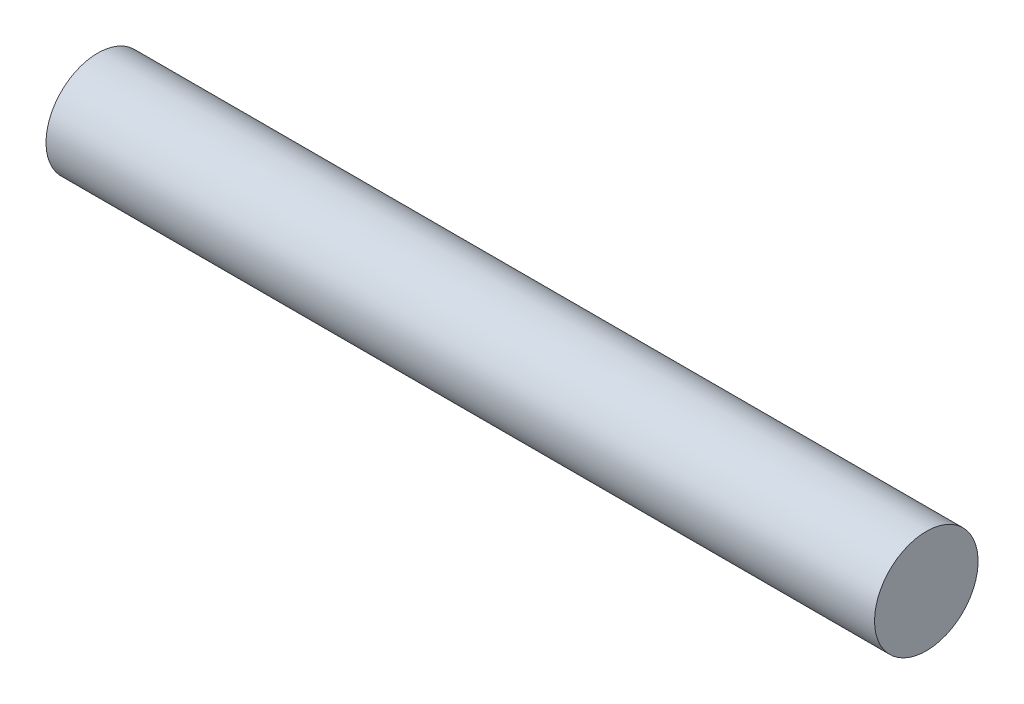
ISO-10303-21;
HEADER;
FILE_DESCRIPTION(('STEP AP214'),'2;1');
FILE_NAME('part.step','',(''),(''),'','','');
FILE_SCHEMA(('AUTOMOTIVE_DESIGN { 1 0 10303 214 1 1 1 1 }'));
ENDSEC;
DATA;
#1=APPLICATION_CONTEXT('core data for automotive mechanical design processes');
#2=APPLICATION_PROTOCOL_DEFINITION('international standard','automotive_design',2000,#1);
#3=PRODUCT_CONTEXT('',#1,'mechanical');
#4=PRODUCT('Part','Part','',(#3));
#5=PRODUCT_RELATED_PRODUCT_CATEGORY('part','',(#4));
#6=PRODUCT_DEFINITION_FORMATION('','',#4);
#7=PRODUCT_DEFINITION_CONTEXT('part definition',#1,'design');
#8=PRODUCT_DEFINITION('design','',#6,#7);
#9=PRODUCT_DEFINITION_SHAPE('','',#8);
#10=(LENGTH_UNIT() NAMED_UNIT(*) SI_UNIT(.MILLI.,.METRE.));
#11=(NAMED_UNIT(*) PLANE_ANGLE_UNIT() SI_UNIT($,.RADIAN.));
#12=(NAMED_UNIT(*) SI_UNIT($,.STERADIAN.) SOLID_ANGLE_UNIT());
#13=UNCERTAINTY_MEASURE_WITH_UNIT(LENGTH_MEASURE(1.E-05),#10,'distance_accuracy_value','');
#14=(GEOMETRIC_REPRESENTATION_CONTEXT(3) GLOBAL_UNCERTAINTY_ASSIGNED_CONTEXT((#13)) GLOBAL_UNIT_ASSIGNED_CONTEXT((#10,
#11,#12)) REPRESENTATION_CONTEXT('',''));
#15=CARTESIAN_POINT('',(0.,0.,0.));
#16=DIRECTION('',(0.,0.,1.));
#17=DIRECTION('',(1.,0.,0.));
#18=AXIS2_PLACEMENT_3D('',#15,#16,#17);
#19=CARTESIAN_POINT('',(381.,0.,0.));
#20=DIRECTION('',(1.,0.,0.));
#21=DIRECTION('',(0.,0.,-1.));
#22=AXIS2_PLACEMENT_3D('',#19,#20,#21);
#23=PLANE('',#22);
#24=CARTESIAN_POINT('',(381.,0.,0.));
#25=DIRECTION('',(-1.,0.,0.));
#26=DIRECTION('',(0.,0.,1.));
#27=AXIS2_PLACEMENT_3D('',#24,#25,#26);
#28=CIRCLE('',#27,23.8125);
#29=CARTESIAN_POINT('',(381.,0.,23.8125));
#30=VERTEX_POINT('',#29);
#31=EDGE_CURVE('E18',#30,#30,#28,.T.);
#32=ORIENTED_EDGE('',*,*,#31,.F.);
#33=EDGE_LOOP('',(#32));
#34=FACE_BOUND('',#33,.T.);
#35=ADVANCED_FACE('F15',(#34),#23,.T.);
#36=CARTESIAN_POINT('',(0.,0.,0.));
#37=DIRECTION('',(1.,0.,0.));
#38=DIRECTION('',(0.,0.,-1.));
#39=AXIS2_PLACEMENT_3D('',#36,#37,#38);
#40=PLANE('',#39);
#41=CARTESIAN_POINT('',(0.,0.,0.));
#42=DIRECTION('',(-1.,0.,0.));
#43=DIRECTION('',(0.,0.,1.));
#44=AXIS2_PLACEMENT_3D('',#41,#42,#43);
#45=CIRCLE('',#44,23.8125);
#46=CARTESIAN_POINT('',(0.,0.,23.8125));
#47=VERTEX_POINT('',#46);
#48=EDGE_CURVE('E10',#47,#47,#45,.F.);
#49=ORIENTED_EDGE('',*,*,#48,.F.);
#50=EDGE_LOOP('',(#49));
#51=FACE_BOUND('',#50,.T.);
#52=ADVANCED_FACE('F30',(#51),#40,.F.);
#53=CARTESIAN_POINT('',(381.,0.,0.));
#54=DIRECTION('',(-1.,0.,0.));
#55=DIRECTION('',(0.,0.,1.));
#56=AXIS2_PLACEMENT_3D('',#53,#54,#55);
#57=CYLINDRICAL_SURFACE('',#56,23.8125);
#58=ORIENTED_EDGE('',*,*,#48,.T.);
#59=EDGE_LOOP('',(#58));
#60=FACE_BOUND('',#59,.T.);
#61=ORIENTED_EDGE('',*,*,#31,.T.);
#62=EDGE_LOOP('',(#61));
#63=FACE_BOUND('',#62,.T.);
#64=ADVANCED_FACE('F27',(#60,#63),#57,.T.);
#65=CLOSED_SHELL('',(#35,#52,#64));
#66=MANIFOLD_SOLID_BREP('B1',#65);
#67=ADVANCED_BREP_SHAPE_REPRESENTATION('',(#18,#66),#14);
#68=SHAPE_DEFINITION_REPRESENTATION(#9,#67);
ENDSEC;
END-ISO-10303-21;
